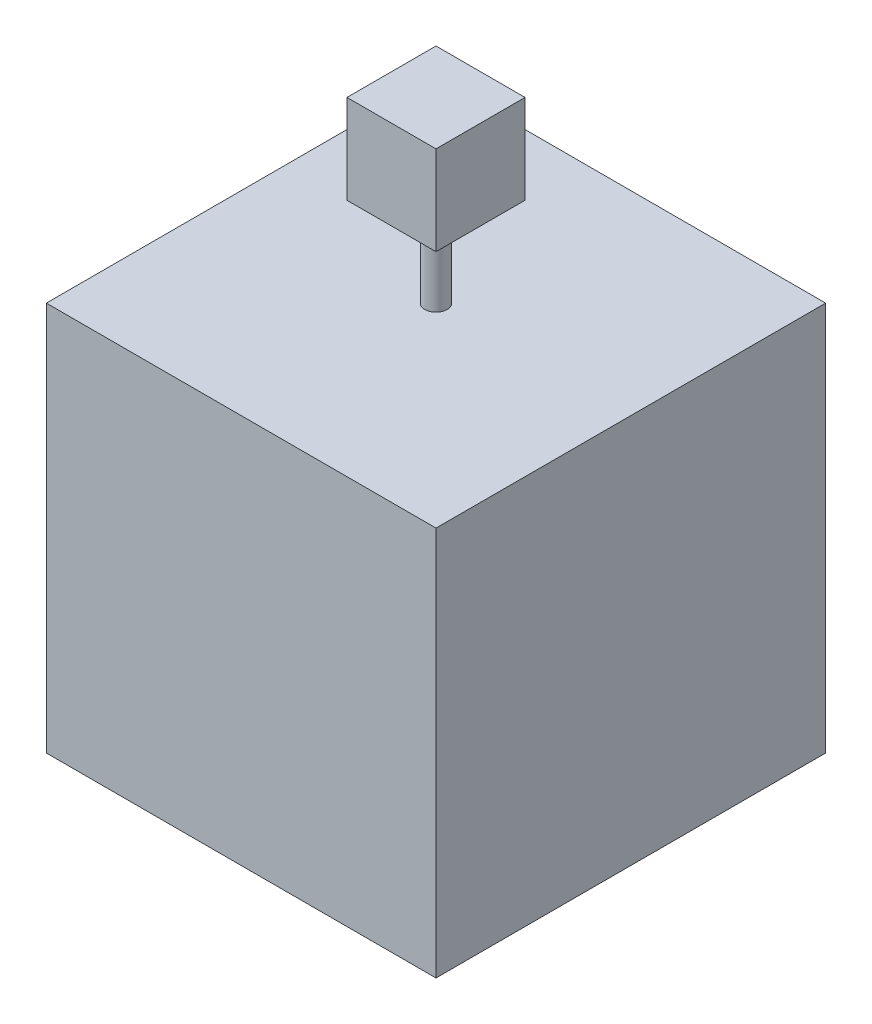
ISO-10303-21;
HEADER;
FILE_DESCRIPTION(('STEP AP214'),'2;1');
FILE_NAME('part.step','',(''),(''),'','','');
FILE_SCHEMA(('AUTOMOTIVE_DESIGN { 1 0 10303 214 1 1 1 1 }'));
ENDSEC;
DATA;
#1=APPLICATION_CONTEXT('core data for automotive mechanical design processes');
#2=APPLICATION_PROTOCOL_DEFINITION('international standard','automotive_design',2000,#1);
#3=PRODUCT_CONTEXT('',#1,'mechanical');
#4=PRODUCT('Part','Part','',(#3));
#5=PRODUCT_RELATED_PRODUCT_CATEGORY('part','',(#4));
#6=PRODUCT_DEFINITION_FORMATION('','',#4);
#7=PRODUCT_DEFINITION_CONTEXT('part definition',#1,'design');
#8=PRODUCT_DEFINITION('design','',#6,#7);
#9=PRODUCT_DEFINITION_SHAPE('','',#8);
#10=(LENGTH_UNIT() NAMED_UNIT(*) SI_UNIT(.MILLI.,.METRE.));
#11=(NAMED_UNIT(*) PLANE_ANGLE_UNIT() SI_UNIT($,.RADIAN.));
#12=(NAMED_UNIT(*) SI_UNIT($,.STERADIAN.) SOLID_ANGLE_UNIT());
#13=UNCERTAINTY_MEASURE_WITH_UNIT(LENGTH_MEASURE(1.E-05),#10,'distance_accuracy_value','');
#14=(GEOMETRIC_REPRESENTATION_CONTEXT(3) GLOBAL_UNCERTAINTY_ASSIGNED_CONTEXT((#13)) GLOBAL_UNIT_ASSIGNED_CONTEXT((#10,
#11,#12)) REPRESENTATION_CONTEXT('',''));
#15=CARTESIAN_POINT('',(0.,0.,0.));
#16=DIRECTION('',(0.,0.,1.));
#17=DIRECTION('',(1.,0.,0.));
#18=AXIS2_PLACEMENT_3D('',#15,#16,#17);
#19=CARTESIAN_POINT('',(0.,350.,-350.));
#20=DIRECTION('',(0.,-1.,0.));
#21=DIRECTION('',(0.,0.,-1.));
#22=AXIS2_PLACEMENT_3D('',#19,#20,#21);
#23=PLANE('',#22);
#24=DIRECTION('',(0.,0.,1.));
#25=VECTOR('',#24,1.);
#26=CARTESIAN_POINT('',(0.,350.,0.));
#27=LINE('',#26,#25);
#28=CARTESIAN_POINT('',(0.,350.,-350.));
#29=VERTEX_POINT('',#28);
#30=CARTESIAN_POINT('',(0.,350.,0.));
#31=VERTEX_POINT('',#30);
#32=EDGE_CURVE('E141',#29,#31,#27,.T.);
#33=ORIENTED_EDGE('',*,*,#32,.T.);
#34=DIRECTION('',(1.,0.,0.));
#35=VECTOR('',#34,1.);
#36=CARTESIAN_POINT('',(0.,350.,0.));
#37=LINE('',#36,#35);
#38=CARTESIAN_POINT('',(350.,350.,0.));
#39=VERTEX_POINT('',#38);
#40=EDGE_CURVE('E80',#31,#39,#37,.T.);
#41=ORIENTED_EDGE('',*,*,#40,.T.);
#42=DIRECTION('',(0.,0.,-1.));
#43=VECTOR('',#42,1.);
#44=CARTESIAN_POINT('',(350.,350.,0.));
#45=LINE('',#44,#43);
#46=CARTESIAN_POINT('',(350.,350.,-350.));
#47=VERTEX_POINT('',#46);
#48=EDGE_CURVE('E144',#39,#47,#45,.T.);
#49=ORIENTED_EDGE('',*,*,#48,.T.);
#50=DIRECTION('',(-1.,0.,0.));
#51=VECTOR('',#50,1.);
#52=CARTESIAN_POINT('',(0.,350.,-350.));
#53=LINE('',#52,#51);
#54=EDGE_CURVE('E48',#47,#29,#53,.T.);
#55=ORIENTED_EDGE('',*,*,#54,.T.);
#56=EDGE_LOOP('',(#33,#41,#49,#55));
#57=FACE_BOUND('',#56,.T.);
#58=CARTESIAN_POINT('',(175.,350.,-175.));
#59=DIRECTION('',(0.,-1.,0.));
#60=DIRECTION('',(0.,0.,-1.));
#61=AXIS2_PLACEMENT_3D('',#58,#59,#60);
#62=CIRCLE('',#61,10.);
#63=CARTESIAN_POINT('',(175.,350.,-185.));
#64=VERTEX_POINT('',#63);
#65=EDGE_CURVE('E11',#64,#64,#62,.F.);
#66=ORIENTED_EDGE('',*,*,#65,.F.);
#67=EDGE_LOOP('',(#66));
#68=FACE_BOUND('',#67,.T.);
#69=ADVANCED_FACE('F31',(#57,#68),#23,.F.);
#70=CARTESIAN_POINT('',(0.,350.,0.));
#71=DIRECTION('',(1.,0.,0.));
#72=DIRECTION('',(0.,0.,-1.));
#73=AXIS2_PLACEMENT_3D('',#70,#71,#72);
#74=PLANE('',#73);
#75=DIRECTION('',(0.,0.,1.));
#76=VECTOR('',#75,1.);
#77=CARTESIAN_POINT('',(0.,0.,0.));
#78=LINE('',#77,#76);
#79=CARTESIAN_POINT('',(0.,0.,-350.));
#80=VERTEX_POINT('',#79);
#81=CARTESIAN_POINT('',(0.,0.,0.));
#82=VERTEX_POINT('',#81);
#83=EDGE_CURVE('E135',#80,#82,#78,.T.);
#84=ORIENTED_EDGE('',*,*,#83,.T.);
#85=DIRECTION('',(0.,-1.,0.));
#86=VECTOR('',#85,1.);
#87=CARTESIAN_POINT('',(0.,350.,0.));
#88=LINE('',#87,#86);
#89=EDGE_CURVE('E40',#31,#82,#88,.T.);
#90=ORIENTED_EDGE('',*,*,#89,.F.);
#91=ORIENTED_EDGE('',*,*,#32,.F.);
#92=DIRECTION('',(0.,-1.,0.));
#93=VECTOR('',#92,1.);
#94=CARTESIAN_POINT('',(0.,350.,-350.));
#95=LINE('',#94,#93);
#96=EDGE_CURVE('E147',#29,#80,#95,.T.);
#97=ORIENTED_EDGE('',*,*,#96,.T.);
#98=EDGE_LOOP('',(#84,#90,#91,#97));
#99=FACE_BOUND('',#98,.T.);
#100=ADVANCED_FACE('F33',(#99),#74,.F.);
#101=CARTESIAN_POINT('',(0.,350.,0.));
#102=DIRECTION('',(0.,0.,-1.));
#103=DIRECTION('',(-1.,0.,0.));
#104=AXIS2_PLACEMENT_3D('',#101,#102,#103);
#105=PLANE('',#104);
#106=DIRECTION('',(1.,0.,0.));
#107=VECTOR('',#106,1.);
#108=CARTESIAN_POINT('',(0.,0.,0.));
#109=LINE('',#108,#107);
#110=CARTESIAN_POINT('',(350.,0.,0.));
#111=VERTEX_POINT('',#110);
#112=EDGE_CURVE('E150',#82,#111,#109,.T.);
#113=ORIENTED_EDGE('',*,*,#112,.T.);
#114=DIRECTION('',(0.,-1.,0.));
#115=VECTOR('',#114,1.);
#116=CARTESIAN_POINT('',(350.,350.,0.));
#117=LINE('',#116,#115);
#118=EDGE_CURVE('E157',#39,#111,#117,.T.);
#119=ORIENTED_EDGE('',*,*,#118,.F.);
#120=ORIENTED_EDGE('',*,*,#40,.F.);
#121=ORIENTED_EDGE('',*,*,#89,.T.);
#122=EDGE_LOOP('',(#113,#119,#120,#121));
#123=FACE_BOUND('',#122,.T.);
#124=ADVANCED_FACE('F159',(#123),#105,.F.);
#125=CARTESIAN_POINT('',(350.,350.,0.));
#126=DIRECTION('',(-1.,0.,0.));
#127=DIRECTION('',(0.,0.,1.));
#128=AXIS2_PLACEMENT_3D('',#125,#126,#127);
#129=PLANE('',#128);
#130=DIRECTION('',(0.,0.,-1.));
#131=VECTOR('',#130,1.);
#132=CARTESIAN_POINT('',(350.,0.,0.));
#133=LINE('',#132,#131);
#134=CARTESIAN_POINT('',(350.,0.,-350.));
#135=VERTEX_POINT('',#134);
#136=EDGE_CURVE('E66',#111,#135,#133,.T.);
#137=ORIENTED_EDGE('',*,*,#136,.T.);
#138=DIRECTION('',(0.,-1.,0.));
#139=VECTOR('',#138,1.);
#140=CARTESIAN_POINT('',(350.,350.,-350.));
#141=LINE('',#140,#139);
#142=EDGE_CURVE('E155',#47,#135,#141,.T.);
#143=ORIENTED_EDGE('',*,*,#142,.F.);
#144=ORIENTED_EDGE('',*,*,#48,.F.);
#145=ORIENTED_EDGE('',*,*,#118,.T.);
#146=EDGE_LOOP('',(#137,#143,#144,#145));
#147=FACE_BOUND('',#146,.T.);
#148=ADVANCED_FACE('F176',(#147),#129,.F.);
#149=CARTESIAN_POINT('',(0.,350.,-350.));
#150=DIRECTION('',(0.,0.,1.));
#151=DIRECTION('',(1.,0.,0.));
#152=AXIS2_PLACEMENT_3D('',#149,#150,#151);
#153=PLANE('',#152);
#154=DIRECTION('',(-1.,0.,0.));
#155=VECTOR('',#154,1.);
#156=CARTESIAN_POINT('',(0.,0.,-350.));
#157=LINE('',#156,#155);
#158=EDGE_CURVE('E72',#135,#80,#157,.T.);
#159=ORIENTED_EDGE('',*,*,#158,.T.);
#160=ORIENTED_EDGE('',*,*,#96,.F.);
#161=ORIENTED_EDGE('',*,*,#54,.F.);
#162=ORIENTED_EDGE('',*,*,#142,.T.);
#163=EDGE_LOOP('',(#159,#160,#161,#162));
#164=FACE_BOUND('',#163,.T.);
#165=ADVANCED_FACE('F167',(#164),#153,.F.);
#166=CARTESIAN_POINT('',(0.,0.,-350.));
#167=DIRECTION('',(0.,-1.,0.));
#168=DIRECTION('',(0.,0.,-1.));
#169=AXIS2_PLACEMENT_3D('',#166,#167,#168);
#170=PLANE('',#169);
#171=ORIENTED_EDGE('',*,*,#83,.F.);
#172=ORIENTED_EDGE('',*,*,#158,.F.);
#173=ORIENTED_EDGE('',*,*,#136,.F.);
#174=ORIENTED_EDGE('',*,*,#112,.F.);
#175=EDGE_LOOP('',(#171,#172,#173,#174));
#176=FACE_BOUND('',#175,.T.);
#177=ADVANCED_FACE('F164',(#176),#170,.T.);
#178=CARTESIAN_POINT('',(175.,430.,-175.));
#179=DIRECTION('',(0.,-1.,0.));
#180=DIRECTION('',(0.,0.,-1.));
#181=AXIS2_PLACEMENT_3D('',#178,#179,#180);
#182=CYLINDRICAL_SURFACE('',#181,10.);
#183=CARTESIAN_POINT('',(175.,430.,-175.));
#184=DIRECTION('',(0.,1.,0.));
#185=DIRECTION('',(0.,0.,1.));
#186=AXIS2_PLACEMENT_3D('',#183,#184,#185);
#187=CIRCLE('',#186,10.);
#188=CARTESIAN_POINT('',(175.,430.,-165.));
#189=VERTEX_POINT('',#188);
#190=EDGE_CURVE('E132',#189,#189,#187,.T.);
#191=ORIENTED_EDGE('',*,*,#190,.F.);
#192=EDGE_LOOP('',(#191));
#193=FACE_BOUND('',#192,.T.);
#194=ORIENTED_EDGE('',*,*,#65,.T.);
#195=EDGE_LOOP('',(#194));
#196=FACE_BOUND('',#195,.T.);
#197=ADVANCED_FACE('F166',(#193,#196),#182,.T.);
#198=CARTESIAN_POINT('',(135.,430.,-135.));
#199=DIRECTION('',(0.,1.,0.));
#200=DIRECTION('',(0.,0.,1.));
#201=AXIS2_PLACEMENT_3D('',#198,#199,#200);
#202=PLANE('',#201);
#203=DIRECTION('',(0.,0.,1.));
#204=VECTOR('',#203,1.);
#205=CARTESIAN_POINT('',(135.,430.,-215.));
#206=LINE('',#205,#204);
#207=CARTESIAN_POINT('',(135.,430.,-215.));
#208=VERTEX_POINT('',#207);
#209=CARTESIAN_POINT('',(135.,430.,-135.));
#210=VERTEX_POINT('',#209);
#211=EDGE_CURVE('E131',#208,#210,#206,.T.);
#212=ORIENTED_EDGE('',*,*,#211,.F.);
#213=DIRECTION('',(-1.,0.,0.));
#214=VECTOR('',#213,1.);
#215=CARTESIAN_POINT('',(135.,430.,-215.));
#216=LINE('',#215,#214);
#217=CARTESIAN_POINT('',(215.,430.,-215.));
#218=VERTEX_POINT('',#217);
#219=EDGE_CURVE('E127',#218,#208,#216,.T.);
#220=ORIENTED_EDGE('',*,*,#219,.F.);
#221=DIRECTION('',(0.,0.,-1.));
#222=VECTOR('',#221,1.);
#223=CARTESIAN_POINT('',(215.,430.,-215.));
#224=LINE('',#223,#222);
#225=CARTESIAN_POINT('',(215.,430.,-135.));
#226=VERTEX_POINT('',#225);
#227=EDGE_CURVE('E286',#226,#218,#224,.T.);
#228=ORIENTED_EDGE('',*,*,#227,.F.);
#229=DIRECTION('',(1.,0.,0.));
#230=VECTOR('',#229,1.);
#231=CARTESIAN_POINT('',(135.,430.,-135.));
#232=LINE('',#231,#230);
#233=EDGE_CURVE('E284',#210,#226,#232,.T.);
#234=ORIENTED_EDGE('',*,*,#233,.F.);
#235=EDGE_LOOP('',(#212,#220,#228,#234));
#236=FACE_BOUND('',#235,.T.);
#237=ORIENTED_EDGE('',*,*,#190,.T.);
#238=EDGE_LOOP('',(#237));
#239=FACE_BOUND('',#238,.T.);
#240=ADVANCED_FACE('F173',(#236,#239),#202,.F.);
#241=CARTESIAN_POINT('',(135.,510.,-215.));
#242=DIRECTION('',(1.,0.,0.));
#243=DIRECTION('',(0.,0.,-1.));
#244=AXIS2_PLACEMENT_3D('',#241,#242,#243);
#245=PLANE('',#244);
#246=ORIENTED_EDGE('',*,*,#211,.T.);
#247=DIRECTION('',(0.,-1.,0.));
#248=VECTOR('',#247,1.);
#249=CARTESIAN_POINT('',(135.,510.,-135.));
#250=LINE('',#249,#248);
#251=CARTESIAN_POINT('',(135.,510.,-135.));
#252=VERTEX_POINT('',#251);
#253=EDGE_CURVE('E111',#252,#210,#250,.T.);
#254=ORIENTED_EDGE('',*,*,#253,.F.);
#255=DIRECTION('',(0.,0.,1.));
#256=VECTOR('',#255,1.);
#257=CARTESIAN_POINT('',(135.,510.,-215.));
#258=LINE('',#257,#256);
#259=CARTESIAN_POINT('',(135.,510.,-215.));
#260=VERTEX_POINT('',#259);
#261=EDGE_CURVE('E118',#260,#252,#258,.T.);
#262=ORIENTED_EDGE('',*,*,#261,.F.);
#263=DIRECTION('',(0.,-1.,0.));
#264=VECTOR('',#263,1.);
#265=CARTESIAN_POINT('',(135.,510.,-215.));
#266=LINE('',#265,#264);
#267=EDGE_CURVE('E293',#260,#208,#266,.T.);
#268=ORIENTED_EDGE('',*,*,#267,.T.);
#269=EDGE_LOOP('',(#246,#254,#262,#268));
#270=FACE_BOUND('',#269,.T.);
#271=ADVANCED_FACE('F129',(#270),#245,.F.);
#272=CARTESIAN_POINT('',(135.,510.,-135.));
#273=DIRECTION('',(0.,0.,-1.));
#274=DIRECTION('',(-1.,0.,0.));
#275=AXIS2_PLACEMENT_3D('',#272,#273,#274);
#276=PLANE('',#275);
#277=ORIENTED_EDGE('',*,*,#233,.T.);
#278=DIRECTION('',(0.,-1.,0.));
#279=VECTOR('',#278,1.);
#280=CARTESIAN_POINT('',(215.,510.,-135.));
#281=LINE('',#280,#279);
#282=CARTESIAN_POINT('',(215.,510.,-135.));
#283=VERTEX_POINT('',#282);
#284=EDGE_CURVE('E114',#283,#226,#281,.T.);
#285=ORIENTED_EDGE('',*,*,#284,.F.);
#286=DIRECTION('',(1.,0.,0.));
#287=VECTOR('',#286,1.);
#288=CARTESIAN_POINT('',(135.,510.,-135.));
#289=LINE('',#288,#287);
#290=EDGE_CURVE('E107',#252,#283,#289,.T.);
#291=ORIENTED_EDGE('',*,*,#290,.F.);
#292=ORIENTED_EDGE('',*,*,#253,.T.);
#293=EDGE_LOOP('',(#277,#285,#291,#292));
#294=FACE_BOUND('',#293,.T.);
#295=ADVANCED_FACE('F109',(#294),#276,.F.);
#296=CARTESIAN_POINT('',(215.,510.,-215.));
#297=DIRECTION('',(-1.,0.,0.));
#298=DIRECTION('',(0.,0.,1.));
#299=AXIS2_PLACEMENT_3D('',#296,#297,#298);
#300=PLANE('',#299);
#301=ORIENTED_EDGE('',*,*,#227,.T.);
#302=DIRECTION('',(0.,-1.,0.));
#303=VECTOR('',#302,1.);
#304=CARTESIAN_POINT('',(215.,510.,-215.));
#305=LINE('',#304,#303);
#306=CARTESIAN_POINT('',(215.,510.,-215.));
#307=VERTEX_POINT('',#306);
#308=EDGE_CURVE('E137',#307,#218,#305,.T.);
#309=ORIENTED_EDGE('',*,*,#308,.F.);
#310=DIRECTION('',(0.,0.,-1.));
#311=VECTOR('',#310,1.);
#312=CARTESIAN_POINT('',(215.,510.,-215.));
#313=LINE('',#312,#311);
#314=EDGE_CURVE('E117',#283,#307,#313,.T.);
#315=ORIENTED_EDGE('',*,*,#314,.F.);
#316=ORIENTED_EDGE('',*,*,#284,.T.);
#317=EDGE_LOOP('',(#301,#309,#315,#316));
#318=FACE_BOUND('',#317,.T.);
#319=ADVANCED_FACE('F189',(#318),#300,.F.);
#320=CARTESIAN_POINT('',(135.,510.,-215.));
#321=DIRECTION('',(0.,0.,1.));
#322=DIRECTION('',(1.,0.,0.));
#323=AXIS2_PLACEMENT_3D('',#320,#321,#322);
#324=PLANE('',#323);
#325=ORIENTED_EDGE('',*,*,#219,.T.);
#326=ORIENTED_EDGE('',*,*,#267,.F.);
#327=DIRECTION('',(-1.,0.,0.));
#328=VECTOR('',#327,1.);
#329=CARTESIAN_POINT('',(135.,510.,-215.));
#330=LINE('',#329,#328);
#331=EDGE_CURVE('E123',#307,#260,#330,.T.);
#332=ORIENTED_EDGE('',*,*,#331,.F.);
#333=ORIENTED_EDGE('',*,*,#308,.T.);
#334=EDGE_LOOP('',(#325,#326,#332,#333));
#335=FACE_BOUND('',#334,.T.);
#336=ADVANCED_FACE('F192',(#335),#324,.F.);
#337=CARTESIAN_POINT('',(135.,510.,-135.));
#338=DIRECTION('',(0.,1.,0.));
#339=DIRECTION('',(0.,0.,1.));
#340=AXIS2_PLACEMENT_3D('',#337,#338,#339);
#341=PLANE('',#340);
#342=ORIENTED_EDGE('',*,*,#261,.T.);
#343=ORIENTED_EDGE('',*,*,#290,.T.);
#344=ORIENTED_EDGE('',*,*,#314,.T.);
#345=ORIENTED_EDGE('',*,*,#331,.T.);
#346=EDGE_LOOP('',(#342,#343,#344,#345));
#347=FACE_BOUND('',#346,.T.);
#348=ADVANCED_FACE('F121',(#347),#341,.T.);
#349=CLOSED_SHELL('',(#69,#100,#124,#148,#165,#177,#197,#240,#271,#295,#319,#336,#348));
#350=MANIFOLD_SOLID_BREP('B2',#349);
#351=ADVANCED_BREP_SHAPE_REPRESENTATION('',(#18,#350),#14);
#352=SHAPE_DEFINITION_REPRESENTATION(#9,#351);
ENDSEC;
END-ISO-10303-21;
